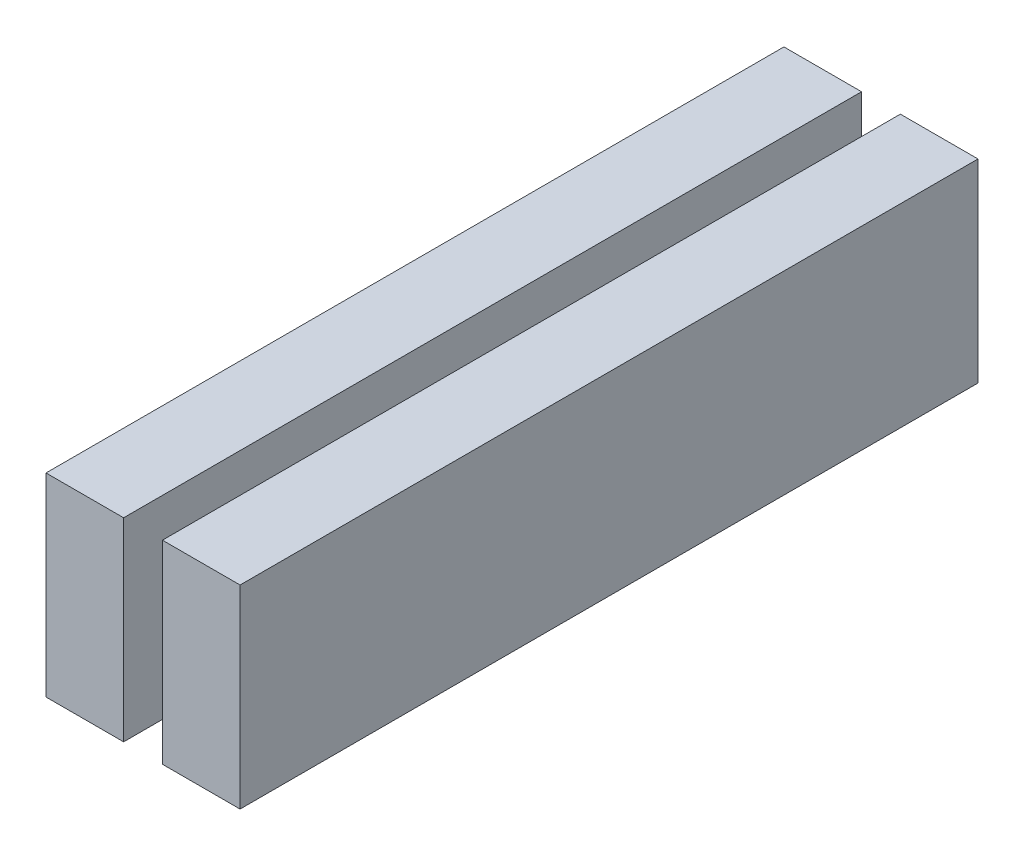
ISO-10303-21;
HEADER;
FILE_DESCRIPTION(('STEP AP214'),'2;1');
FILE_NAME('part.step','',(''),(''),'','','');
FILE_SCHEMA(('AUTOMOTIVE_DESIGN { 1 0 10303 214 1 1 1 1 }'));
ENDSEC;
DATA;
#1=APPLICATION_CONTEXT('core data for automotive mechanical design processes');
#2=APPLICATION_PROTOCOL_DEFINITION('international standard','automotive_design',2000,#1);
#3=PRODUCT_CONTEXT('',#1,'mechanical');
#4=PRODUCT('Part','Part','',(#3));
#5=PRODUCT_RELATED_PRODUCT_CATEGORY('part','',(#4));
#6=PRODUCT_DEFINITION_FORMATION('','',#4);
#7=PRODUCT_DEFINITION_CONTEXT('part definition',#1,'design');
#8=PRODUCT_DEFINITION('design','',#6,#7);
#9=PRODUCT_DEFINITION_SHAPE('','',#8);
#10=(LENGTH_UNIT() NAMED_UNIT(*) SI_UNIT(.MILLI.,.METRE.));
#11=(NAMED_UNIT(*) PLANE_ANGLE_UNIT() SI_UNIT($,.RADIAN.));
#12=(NAMED_UNIT(*) SI_UNIT($,.STERADIAN.) SOLID_ANGLE_UNIT());
#13=UNCERTAINTY_MEASURE_WITH_UNIT(LENGTH_MEASURE(1.E-05),#10,'distance_accuracy_value','');
#14=(GEOMETRIC_REPRESENTATION_CONTEXT(3) GLOBAL_UNCERTAINTY_ASSIGNED_CONTEXT((#13)) GLOBAL_UNIT_ASSIGNED_CONTEXT((#10,
#11,#12)) REPRESENTATION_CONTEXT('',''));
#15=CARTESIAN_POINT('',(0.,0.,0.));
#16=DIRECTION('',(0.,0.,1.));
#17=DIRECTION('',(1.,0.,0.));
#18=AXIS2_PLACEMENT_3D('',#15,#16,#17);
#19=CARTESIAN_POINT('',(0.,789.,-3000.));
#20=DIRECTION('',(0.,1.,0.));
#21=DIRECTION('',(0.,0.,1.));
#22=AXIS2_PLACEMENT_3D('',#19,#20,#21);
#23=PLANE('',#22);
#24=DIRECTION('',(0.,0.,1.));
#25=VECTOR('',#24,1.);
#26=CARTESIAN_POINT('',(315.6,789.,-3000.));
#27=LINE('',#26,#25);
#28=CARTESIAN_POINT('',(315.6,789.,-3000.));
#29=VERTEX_POINT('',#28);
#30=CARTESIAN_POINT('',(315.6,789.,0.));
#31=VERTEX_POINT('',#30);
#32=EDGE_CURVE('E12',#29,#31,#27,.T.);
#33=ORIENTED_EDGE('',*,*,#32,.F.);
#34=DIRECTION('',(-1.,0.,0.));
#35=VECTOR('',#34,1.);
#36=CARTESIAN_POINT('',(0.,789.,-3000.));
#37=LINE('',#36,#35);
#38=CARTESIAN_POINT('',(0.,789.,-3000.));
#39=VERTEX_POINT('',#38);
#40=EDGE_CURVE('E97',#29,#39,#37,.T.);
#41=ORIENTED_EDGE('',*,*,#40,.T.);
#42=DIRECTION('',(0.,0.,1.));
#43=VECTOR('',#42,1.);
#44=CARTESIAN_POINT('',(0.,789.,-3000.));
#45=LINE('',#44,#43);
#46=CARTESIAN_POINT('',(0.,789.,0.));
#47=VERTEX_POINT('',#46);
#48=EDGE_CURVE('E85',#39,#47,#45,.T.);
#49=ORIENTED_EDGE('',*,*,#48,.T.);
#50=DIRECTION('',(-1.,0.,0.));
#51=VECTOR('',#50,1.);
#52=CARTESIAN_POINT('',(0.,789.,0.));
#53=LINE('',#52,#51);
#54=EDGE_CURVE('E90',#31,#47,#53,.T.);
#55=ORIENTED_EDGE('',*,*,#54,.F.);
#56=EDGE_LOOP('',(#33,#41,#49,#55));
#57=FACE_BOUND('',#56,.T.);
#58=ADVANCED_FACE('F36',(#57),#23,.T.);
#59=CARTESIAN_POINT('',(0.,0.,-3000.));
#60=DIRECTION('',(0.,-1.,0.));
#61=DIRECTION('',(0.,0.,-1.));
#62=AXIS2_PLACEMENT_3D('',#59,#60,#61);
#63=PLANE('',#62);
#64=DIRECTION('',(0.,0.,1.));
#65=VECTOR('',#64,1.);
#66=CARTESIAN_POINT('',(315.6,0.,-3000.));
#67=LINE('',#66,#65);
#68=CARTESIAN_POINT('',(315.6,0.,-3000.));
#69=VERTEX_POINT('',#68);
#70=CARTESIAN_POINT('',(315.6,0.,0.));
#71=VERTEX_POINT('',#70);
#72=EDGE_CURVE('E70',#69,#71,#67,.T.);
#73=ORIENTED_EDGE('',*,*,#72,.T.);
#74=DIRECTION('',(1.,0.,0.));
#75=VECTOR('',#74,1.);
#76=CARTESIAN_POINT('',(0.,0.,0.));
#77=LINE('',#76,#75);
#78=CARTESIAN_POINT('',(0.,0.,0.));
#79=VERTEX_POINT('',#78);
#80=EDGE_CURVE('E39',#79,#71,#77,.T.);
#81=ORIENTED_EDGE('',*,*,#80,.F.);
#82=DIRECTION('',(0.,0.,1.));
#83=VECTOR('',#82,1.);
#84=CARTESIAN_POINT('',(0.,0.,-3000.));
#85=LINE('',#84,#83);
#86=CARTESIAN_POINT('',(0.,0.,-3000.));
#87=VERTEX_POINT('',#86);
#88=EDGE_CURVE('E76',#87,#79,#85,.T.);
#89=ORIENTED_EDGE('',*,*,#88,.F.);
#90=DIRECTION('',(1.,0.,0.));
#91=VECTOR('',#90,1.);
#92=CARTESIAN_POINT('',(0.,0.,-3000.));
#93=LINE('',#92,#91);
#94=EDGE_CURVE('E84',#87,#69,#93,.T.);
#95=ORIENTED_EDGE('',*,*,#94,.T.);
#96=EDGE_LOOP('',(#73,#81,#89,#95));
#97=FACE_BOUND('',#96,.T.);
#98=ADVANCED_FACE('F81',(#97),#63,.T.);
#99=CARTESIAN_POINT('',(0.,789.,-3000.));
#100=DIRECTION('',(0.,0.,-1.));
#101=DIRECTION('',(-1.,0.,0.));
#102=AXIS2_PLACEMENT_3D('',#99,#100,#101);
#103=PLANE('',#102);
#104=DIRECTION('',(0.,-1.,0.));
#105=VECTOR('',#104,1.);
#106=CARTESIAN_POINT('',(315.6,0.,-3000.));
#107=LINE('',#106,#105);
#108=EDGE_CURVE('E91',#29,#69,#107,.T.);
#109=ORIENTED_EDGE('',*,*,#108,.T.);
#110=ORIENTED_EDGE('',*,*,#94,.F.);
#111=DIRECTION('',(0.,-1.,0.));
#112=VECTOR('',#111,1.);
#113=CARTESIAN_POINT('',(0.,0.,-3000.));
#114=LINE('',#113,#112);
#115=EDGE_CURVE('E104',#39,#87,#114,.T.);
#116=ORIENTED_EDGE('',*,*,#115,.F.);
#117=ORIENTED_EDGE('',*,*,#40,.F.);
#118=EDGE_LOOP('',(#109,#110,#116,#117));
#119=FACE_BOUND('',#118,.T.);
#120=ADVANCED_FACE('F110',(#119),#103,.T.);
#121=CARTESIAN_POINT('',(0.,789.,0.));
#122=DIRECTION('',(0.,0.,-1.));
#123=DIRECTION('',(-1.,0.,0.));
#124=AXIS2_PLACEMENT_3D('',#121,#122,#123);
#125=PLANE('',#124);
#126=ORIENTED_EDGE('',*,*,#80,.T.);
#127=DIRECTION('',(0.,-1.,0.));
#128=VECTOR('',#127,1.);
#129=CARTESIAN_POINT('',(315.6,0.,0.));
#130=LINE('',#129,#128);
#131=EDGE_CURVE('E45',#31,#71,#130,.T.);
#132=ORIENTED_EDGE('',*,*,#131,.F.);
#133=ORIENTED_EDGE('',*,*,#54,.T.);
#134=DIRECTION('',(0.,-1.,0.));
#135=VECTOR('',#134,1.);
#136=CARTESIAN_POINT('',(0.,0.,0.));
#137=LINE('',#136,#135);
#138=EDGE_CURVE('E89',#47,#79,#137,.T.);
#139=ORIENTED_EDGE('',*,*,#138,.T.);
#140=EDGE_LOOP('',(#126,#132,#133,#139));
#141=FACE_BOUND('',#140,.T.);
#142=ADVANCED_FACE('F87',(#141),#125,.F.);
#143=CARTESIAN_POINT('',(0.,0.,-3000.));
#144=DIRECTION('',(-1.,0.,0.));
#145=DIRECTION('',(0.,0.,1.));
#146=AXIS2_PLACEMENT_3D('',#143,#144,#145);
#147=PLANE('',#146);
#148=ORIENTED_EDGE('',*,*,#138,.F.);
#149=ORIENTED_EDGE('',*,*,#48,.F.);
#150=ORIENTED_EDGE('',*,*,#115,.T.);
#151=ORIENTED_EDGE('',*,*,#88,.T.);
#152=EDGE_LOOP('',(#148,#149,#150,#151));
#153=FACE_BOUND('',#152,.T.);
#154=ADVANCED_FACE('F109',(#153),#147,.T.);
#155=CARTESIAN_POINT('',(315.6,0.,-3000.));
#156=DIRECTION('',(-1.,0.,0.));
#157=DIRECTION('',(0.,0.,1.));
#158=AXIS2_PLACEMENT_3D('',#155,#156,#157);
#159=PLANE('',#158);
#160=ORIENTED_EDGE('',*,*,#131,.T.);
#161=ORIENTED_EDGE('',*,*,#72,.F.);
#162=ORIENTED_EDGE('',*,*,#108,.F.);
#163=ORIENTED_EDGE('',*,*,#32,.T.);
#164=EDGE_LOOP('',(#160,#161,#162,#163));
#165=FACE_BOUND('',#164,.T.);
#166=ADVANCED_FACE('F72',(#165),#159,.F.);
#167=CLOSED_SHELL('',(#58,#98,#120,#142,#154,#166));
#168=MANIFOLD_SOLID_BREP('B2',#167);
#169=CARTESIAN_POINT('',(789.,0.,-3000.));
#170=DIRECTION('',(1.,0.,0.));
#171=DIRECTION('',(0.,0.,-1.));
#172=AXIS2_PLACEMENT_3D('',#169,#170,#171);
#173=PLANE('',#172);
#174=DIRECTION('',(0.,1.,0.));
#175=VECTOR('',#174,1.);
#176=CARTESIAN_POINT('',(789.,0.,0.));
#177=LINE('',#176,#175);
#178=CARTESIAN_POINT('',(789.,0.,0.));
#179=VERTEX_POINT('',#178);
#180=CARTESIAN_POINT('',(789.,789.,0.));
#181=VERTEX_POINT('',#180);
#182=EDGE_CURVE('E204',#179,#181,#177,.T.);
#183=ORIENTED_EDGE('',*,*,#182,.F.);
#184=DIRECTION('',(0.,0.,1.));
#185=VECTOR('',#184,1.);
#186=CARTESIAN_POINT('',(789.,0.,-3000.));
#187=LINE('',#186,#185);
#188=CARTESIAN_POINT('',(789.,0.,-3000.));
#189=VERTEX_POINT('',#188);
#190=EDGE_CURVE('E152',#189,#179,#187,.T.);
#191=ORIENTED_EDGE('',*,*,#190,.F.);
#192=DIRECTION('',(0.,1.,0.));
#193=VECTOR('',#192,1.);
#194=CARTESIAN_POINT('',(789.,0.,-3000.));
#195=LINE('',#194,#193);
#196=CARTESIAN_POINT('',(789.,789.,-3000.));
#197=VERTEX_POINT('',#196);
#198=EDGE_CURVE('E207',#189,#197,#195,.T.);
#199=ORIENTED_EDGE('',*,*,#198,.T.);
#200=DIRECTION('',(0.,0.,1.));
#201=VECTOR('',#200,1.);
#202=CARTESIAN_POINT('',(789.,789.,-3000.));
#203=LINE('',#202,#201);
#204=EDGE_CURVE('E34',#197,#181,#203,.T.);
#205=ORIENTED_EDGE('',*,*,#204,.T.);
#206=EDGE_LOOP('',(#183,#191,#199,#205));
#207=FACE_BOUND('',#206,.T.);
#208=ADVANCED_FACE('F148',(#207),#173,.T.);
#209=CARTESIAN_POINT('',(0.,789.,0.));
#210=DIRECTION('',(0.,0.,-1.));
#211=DIRECTION('',(-1.,0.,0.));
#212=AXIS2_PLACEMENT_3D('',#209,#210,#211);
#213=PLANE('',#212);
#214=DIRECTION('',(-1.,0.,0.));
#215=VECTOR('',#214,1.);
#216=CARTESIAN_POINT('',(0.,789.,0.));
#217=LINE('',#216,#215);
#218=CARTESIAN_POINT('',(473.4,789.,0.));
#219=VERTEX_POINT('',#218);
#220=EDGE_CURVE('E196',#181,#219,#217,.T.);
#221=ORIENTED_EDGE('',*,*,#220,.T.);
#222=DIRECTION('',(0.,1.,0.));
#223=VECTOR('',#222,1.);
#224=CARTESIAN_POINT('',(473.4,0.,0.));
#225=LINE('',#224,#223);
#226=CARTESIAN_POINT('',(473.4,0.,0.));
#227=VERTEX_POINT('',#226);
#228=EDGE_CURVE('E185',#227,#219,#225,.T.);
#229=ORIENTED_EDGE('',*,*,#228,.F.);
#230=DIRECTION('',(1.,0.,0.));
#231=VECTOR('',#230,1.);
#232=CARTESIAN_POINT('',(0.,0.,0.));
#233=LINE('',#232,#231);
#234=EDGE_CURVE('E199',#227,#179,#233,.T.);
#235=ORIENTED_EDGE('',*,*,#234,.T.);
#236=ORIENTED_EDGE('',*,*,#182,.T.);
#237=EDGE_LOOP('',(#221,#229,#235,#236));
#238=FACE_BOUND('',#237,.T.);
#239=ADVANCED_FACE('F202',(#238),#213,.F.);
#240=CARTESIAN_POINT('',(0.,789.,-3000.));
#241=DIRECTION('',(0.,0.,-1.));
#242=DIRECTION('',(-1.,0.,0.));
#243=AXIS2_PLACEMENT_3D('',#240,#241,#242);
#244=PLANE('',#243);
#245=DIRECTION('',(0.,1.,0.));
#246=VECTOR('',#245,1.);
#247=CARTESIAN_POINT('',(473.4,0.,-3000.));
#248=LINE('',#247,#246);
#249=CARTESIAN_POINT('',(473.4,0.,-3000.));
#250=VERTEX_POINT('',#249);
#251=CARTESIAN_POINT('',(473.4,789.,-3000.));
#252=VERTEX_POINT('',#251);
#253=EDGE_CURVE('E193',#250,#252,#248,.T.);
#254=ORIENTED_EDGE('',*,*,#253,.T.);
#255=DIRECTION('',(-1.,0.,0.));
#256=VECTOR('',#255,1.);
#257=CARTESIAN_POINT('',(0.,789.,-3000.));
#258=LINE('',#257,#256);
#259=EDGE_CURVE('E198',#197,#252,#258,.T.);
#260=ORIENTED_EDGE('',*,*,#259,.F.);
#261=ORIENTED_EDGE('',*,*,#198,.F.);
#262=DIRECTION('',(1.,0.,0.));
#263=VECTOR('',#262,1.);
#264=CARTESIAN_POINT('',(0.,0.,-3000.));
#265=LINE('',#264,#263);
#266=EDGE_CURVE('E205',#250,#189,#265,.T.);
#267=ORIENTED_EDGE('',*,*,#266,.F.);
#268=EDGE_LOOP('',(#254,#260,#261,#267));
#269=FACE_BOUND('',#268,.T.);
#270=ADVANCED_FACE('F220',(#269),#244,.T.);
#271=CARTESIAN_POINT('',(0.,0.,-3000.));
#272=DIRECTION('',(0.,-1.,0.));
#273=DIRECTION('',(0.,0.,-1.));
#274=AXIS2_PLACEMENT_3D('',#271,#272,#273);
#275=PLANE('',#274);
#276=DIRECTION('',(0.,0.,1.));
#277=VECTOR('',#276,1.);
#278=CARTESIAN_POINT('',(473.4,0.,-3000.));
#279=LINE('',#278,#277);
#280=EDGE_CURVE('E163',#250,#227,#279,.T.);
#281=ORIENTED_EDGE('',*,*,#280,.F.);
#282=ORIENTED_EDGE('',*,*,#266,.T.);
#283=ORIENTED_EDGE('',*,*,#190,.T.);
#284=ORIENTED_EDGE('',*,*,#234,.F.);
#285=EDGE_LOOP('',(#281,#282,#283,#284));
#286=FACE_BOUND('',#285,.T.);
#287=ADVANCED_FACE('F150',(#286),#275,.T.);
#288=CARTESIAN_POINT('',(0.,789.,-3000.));
#289=DIRECTION('',(0.,1.,0.));
#290=DIRECTION('',(0.,0.,1.));
#291=AXIS2_PLACEMENT_3D('',#288,#289,#290);
#292=PLANE('',#291);
#293=DIRECTION('',(0.,0.,1.));
#294=VECTOR('',#293,1.);
#295=CARTESIAN_POINT('',(473.4,789.,-3000.));
#296=LINE('',#295,#294);
#297=EDGE_CURVE('E188',#252,#219,#296,.T.);
#298=ORIENTED_EDGE('',*,*,#297,.T.);
#299=ORIENTED_EDGE('',*,*,#220,.F.);
#300=ORIENTED_EDGE('',*,*,#204,.F.);
#301=ORIENTED_EDGE('',*,*,#259,.T.);
#302=EDGE_LOOP('',(#298,#299,#300,#301));
#303=FACE_BOUND('',#302,.T.);
#304=ADVANCED_FACE('F195',(#303),#292,.T.);
#305=CARTESIAN_POINT('',(473.4,0.,-3000.));
#306=DIRECTION('',(1.,0.,0.));
#307=DIRECTION('',(0.,0.,-1.));
#308=AXIS2_PLACEMENT_3D('',#305,#306,#307);
#309=PLANE('',#308);
#310=ORIENTED_EDGE('',*,*,#228,.T.);
#311=ORIENTED_EDGE('',*,*,#297,.F.);
#312=ORIENTED_EDGE('',*,*,#253,.F.);
#313=ORIENTED_EDGE('',*,*,#280,.T.);
#314=EDGE_LOOP('',(#310,#311,#312,#313));
#315=FACE_BOUND('',#314,.T.);
#316=ADVANCED_FACE('F187',(#315),#309,.F.);
#317=CLOSED_SHELL('',(#208,#239,#270,#287,#304,#316));
#318=MANIFOLD_SOLID_BREP('B6',#317);
#319=ADVANCED_BREP_SHAPE_REPRESENTATION('',(#18,#168,#318),#14);
#320=SHAPE_DEFINITION_REPRESENTATION(#9,#319);
ENDSEC;
END-ISO-10303-21;
